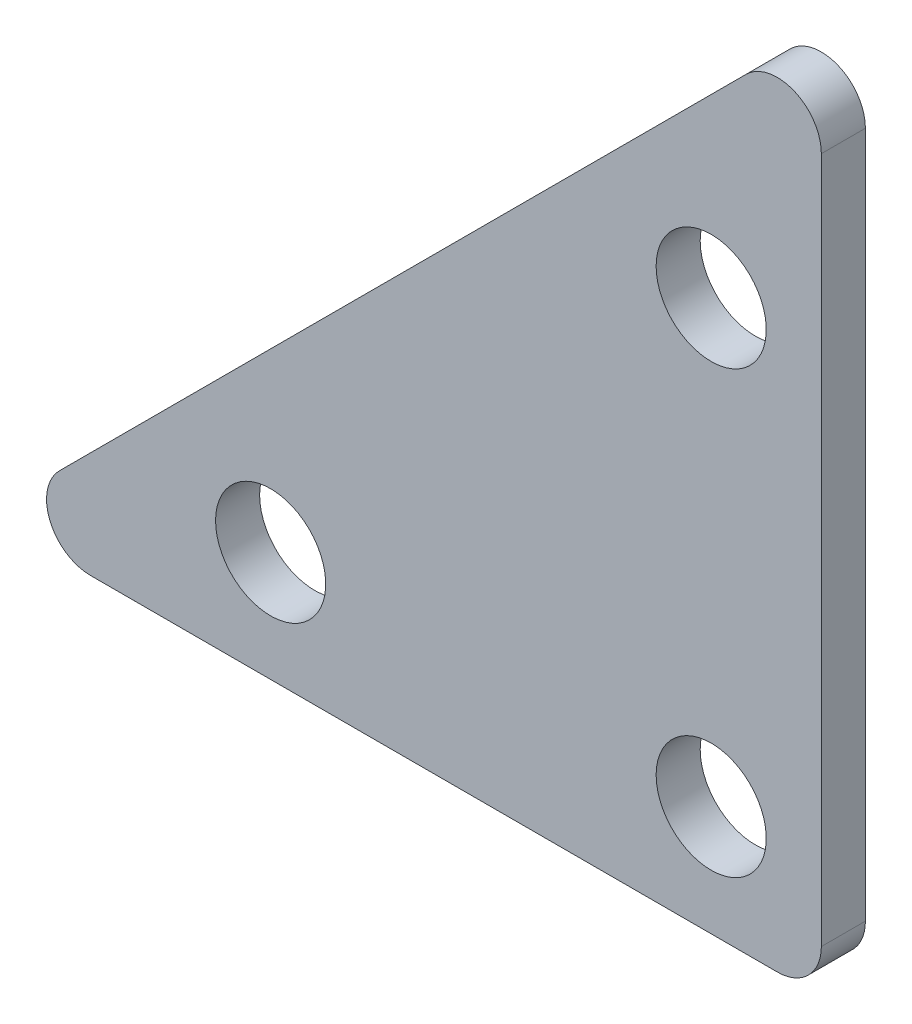
ISO-10303-21;
HEADER;
FILE_DESCRIPTION(('STEP AP214'),'2;1');
FILE_NAME('part.step','',(''),(''),'','','');
FILE_SCHEMA(('AUTOMOTIVE_DESIGN { 1 0 10303 214 1 1 1 1 }'));
ENDSEC;
DATA;
#1=APPLICATION_CONTEXT('core data for automotive mechanical design processes');
#2=APPLICATION_PROTOCOL_DEFINITION('international standard','automotive_design',2000,#1);
#3=PRODUCT_CONTEXT('',#1,'mechanical');
#4=PRODUCT('Part','Part','',(#3));
#5=PRODUCT_RELATED_PRODUCT_CATEGORY('part','',(#4));
#6=PRODUCT_DEFINITION_FORMATION('','',#4);
#7=PRODUCT_DEFINITION_CONTEXT('part definition',#1,'design');
#8=PRODUCT_DEFINITION('design','',#6,#7);
#9=PRODUCT_DEFINITION_SHAPE('','',#8);
#10=(LENGTH_UNIT() NAMED_UNIT(*) SI_UNIT(.MILLI.,.METRE.));
#11=(NAMED_UNIT(*) PLANE_ANGLE_UNIT() SI_UNIT($,.RADIAN.));
#12=(NAMED_UNIT(*) SI_UNIT($,.STERADIAN.) SOLID_ANGLE_UNIT());
#13=UNCERTAINTY_MEASURE_WITH_UNIT(LENGTH_MEASURE(1.E-05),#10,'distance_accuracy_value','');
#14=(GEOMETRIC_REPRESENTATION_CONTEXT(3) GLOBAL_UNCERTAINTY_ASSIGNED_CONTEXT((#13)) GLOBAL_UNIT_ASSIGNED_CONTEXT((#10,
#11,#12)) REPRESENTATION_CONTEXT('',''));
#15=CARTESIAN_POINT('',(0.,0.,0.));
#16=DIRECTION('',(0.,0.,1.));
#17=DIRECTION('',(1.,0.,0.));
#18=AXIS2_PLACEMENT_3D('',#15,#16,#17);
#19=CARTESIAN_POINT('',(-38.,0.,2.));
#20=DIRECTION('',(0.,1.,0.));
#21=DIRECTION('',(0.,0.,1.));
#22=AXIS2_PLACEMENT_3D('',#19,#20,#21);
#23=PLANE('',#22);
#24=DIRECTION('',(1.,0.,0.));
#25=VECTOR('',#24,1.);
#26=CARTESIAN_POINT('',(-38.,0.,0.));
#27=LINE('',#26,#25);
#28=CARTESIAN_POINT('',(-33.1715728752538,0.,0.));
#29=VERTEX_POINT('',#28);
#30=CARTESIAN_POINT('',(-2.,0.,0.));
#31=VERTEX_POINT('',#30);
#32=EDGE_CURVE('E124',#29,#31,#27,.T.);
#33=ORIENTED_EDGE('',*,*,#32,.T.);
#34=DIRECTION('',(0.,0.,-1.));
#35=VECTOR('',#34,1.);
#36=CARTESIAN_POINT('',(-2.,0.,2.));
#37=LINE('',#36,#35);
#38=CARTESIAN_POINT('',(-2.,0.,2.));
#39=VERTEX_POINT('',#38);
#40=EDGE_CURVE('E103',#31,#39,#37,.F.);
#41=ORIENTED_EDGE('',*,*,#40,.T.);
#42=DIRECTION('',(1.,0.,0.));
#43=VECTOR('',#42,1.);
#44=CARTESIAN_POINT('',(-38.,0.,2.));
#45=LINE('',#44,#43);
#46=CARTESIAN_POINT('',(-33.1715728752538,0.,2.));
#47=VERTEX_POINT('',#46);
#48=EDGE_CURVE('E126',#47,#39,#45,.T.);
#49=ORIENTED_EDGE('',*,*,#48,.F.);
#50=DIRECTION('',(0.,0.,-1.));
#51=VECTOR('',#50,1.);
#52=CARTESIAN_POINT('',(-33.1715728752538,0.,2.));
#53=LINE('',#52,#51);
#54=EDGE_CURVE('E108',#47,#29,#53,.T.);
#55=ORIENTED_EDGE('',*,*,#54,.T.);
#56=EDGE_LOOP('',(#33,#41,#49,#55));
#57=FACE_BOUND('',#56,.T.);
#58=ADVANCED_FACE('F44',(#57),#23,.F.);
#59=CARTESIAN_POINT('',(0.,0.,2.));
#60=DIRECTION('',(-1.,0.,0.));
#61=DIRECTION('',(0.,0.,1.));
#62=AXIS2_PLACEMENT_3D('',#59,#60,#61);
#63=PLANE('',#62);
#64=DIRECTION('',(0.,1.,0.));
#65=VECTOR('',#64,1.);
#66=CARTESIAN_POINT('',(0.,0.,2.));
#67=LINE('',#66,#65);
#68=CARTESIAN_POINT('',(0.,2.,2.));
#69=VERTEX_POINT('',#68);
#70=CARTESIAN_POINT('',(0.,33.1715728752538,2.));
#71=VERTEX_POINT('',#70);
#72=EDGE_CURVE('E117',#69,#71,#67,.T.);
#73=ORIENTED_EDGE('',*,*,#72,.F.);
#74=DIRECTION('',(0.,0.,-1.));
#75=VECTOR('',#74,1.);
#76=CARTESIAN_POINT('',(0.,2.,2.));
#77=LINE('',#76,#75);
#78=CARTESIAN_POINT('',(0.,2.,0.));
#79=VERTEX_POINT('',#78);
#80=EDGE_CURVE('E102',#69,#79,#77,.T.);
#81=ORIENTED_EDGE('',*,*,#80,.T.);
#82=DIRECTION('',(0.,1.,0.));
#83=VECTOR('',#82,1.);
#84=CARTESIAN_POINT('',(0.,0.,0.));
#85=LINE('',#84,#83);
#86=CARTESIAN_POINT('',(0.,33.1715728752538,0.));
#87=VERTEX_POINT('',#86);
#88=EDGE_CURVE('E115',#79,#87,#85,.T.);
#89=ORIENTED_EDGE('',*,*,#88,.T.);
#90=DIRECTION('',(0.,0.,-1.));
#91=VECTOR('',#90,1.);
#92=CARTESIAN_POINT('',(0.,33.1715728752538,2.));
#93=LINE('',#92,#91);
#94=EDGE_CURVE('E119',#87,#71,#93,.F.);
#95=ORIENTED_EDGE('',*,*,#94,.T.);
#96=EDGE_LOOP('',(#73,#81,#89,#95));
#97=FACE_BOUND('',#96,.T.);
#98=ADVANCED_FACE('F114',(#97),#63,.F.);
#99=CARTESIAN_POINT('',(0.,38.,2.));
#100=DIRECTION('',(0.707106781186547,-0.707106781186547,0.));
#101=DIRECTION('',(0.707106781186548,0.707106781186548,0.));
#102=AXIS2_PLACEMENT_3D('',#99,#100,#101);
#103=PLANE('',#102);
#104=DIRECTION('',(-0.707106781186548,-0.707106781186548,0.));
#105=VECTOR('',#104,1.);
#106=CARTESIAN_POINT('',(0.,38.,2.));
#107=LINE('',#106,#105);
#108=CARTESIAN_POINT('',(-3.41421356237309,34.5857864376269,2.));
#109=VERTEX_POINT('',#108);
#110=CARTESIAN_POINT('',(-34.5857864376269,3.41421356237309,2.));
#111=VERTEX_POINT('',#110);
#112=EDGE_CURVE('E132',#109,#111,#107,.T.);
#113=ORIENTED_EDGE('',*,*,#112,.F.);
#114=DIRECTION('',(0.,0.,-1.));
#115=VECTOR('',#114,1.);
#116=CARTESIAN_POINT('',(-3.41421356237309,34.5857864376269,2.));
#117=LINE('',#116,#115);
#118=CARTESIAN_POINT('',(-3.41421356237309,34.5857864376269,0.));
#119=VERTEX_POINT('',#118);
#120=EDGE_CURVE('E13',#109,#119,#117,.T.);
#121=ORIENTED_EDGE('',*,*,#120,.T.);
#122=DIRECTION('',(-0.707106781186548,-0.707106781186548,0.));
#123=VECTOR('',#122,1.);
#124=CARTESIAN_POINT('',(0.,38.,0.));
#125=LINE('',#124,#123);
#126=CARTESIAN_POINT('',(-34.5857864376269,3.41421356237309,0.));
#127=VERTEX_POINT('',#126);
#128=EDGE_CURVE('E123',#119,#127,#125,.T.);
#129=ORIENTED_EDGE('',*,*,#128,.T.);
#130=DIRECTION('',(0.,0.,-1.));
#131=VECTOR('',#130,1.);
#132=CARTESIAN_POINT('',(-34.5857864376269,3.4142135623731,2.));
#133=LINE('',#132,#131);
#134=EDGE_CURVE('E52',#127,#111,#133,.F.);
#135=ORIENTED_EDGE('',*,*,#134,.T.);
#136=EDGE_LOOP('',(#113,#121,#129,#135));
#137=FACE_BOUND('',#136,.T.);
#138=ADVANCED_FACE('F155',(#137),#103,.F.);
#139=CARTESIAN_POINT('',(0.,0.,2.));
#140=DIRECTION('',(0.,0.,1.));
#141=DIRECTION('',(1.,0.,0.));
#142=AXIS2_PLACEMENT_3D('',#139,#140,#141);
#143=PLANE('',#142);
#144=CARTESIAN_POINT('',(-5.,25.,2.));
#145=DIRECTION('',(0.,0.,-1.));
#146=DIRECTION('',(-1.,0.,0.));
#147=AXIS2_PLACEMENT_3D('',#144,#145,#146);
#148=CIRCLE('',#147,2.5);
#149=CARTESIAN_POINT('',(-7.5,25.,2.));
#150=VERTEX_POINT('',#149);
#151=EDGE_CURVE('E195',#150,#150,#148,.T.);
#152=ORIENTED_EDGE('',*,*,#151,.T.);
#153=EDGE_LOOP('',(#152));
#154=FACE_BOUND('',#153,.T.);
#155=CARTESIAN_POINT('',(-5.,5.,2.));
#156=DIRECTION('',(0.,0.,-1.));
#157=DIRECTION('',(-1.,0.,0.));
#158=AXIS2_PLACEMENT_3D('',#155,#156,#157);
#159=CIRCLE('',#158,2.5);
#160=CARTESIAN_POINT('',(-7.5,5.,2.));
#161=VERTEX_POINT('',#160);
#162=EDGE_CURVE('E205',#161,#161,#159,.T.);
#163=ORIENTED_EDGE('',*,*,#162,.T.);
#164=EDGE_LOOP('',(#163));
#165=FACE_BOUND('',#164,.T.);
#166=CARTESIAN_POINT('',(-25.,5.,2.));
#167=DIRECTION('',(0.,0.,-1.));
#168=DIRECTION('',(-1.,0.,0.));
#169=AXIS2_PLACEMENT_3D('',#166,#167,#168);
#170=CIRCLE('',#169,2.5);
#171=CARTESIAN_POINT('',(-27.5,5.,2.));
#172=VERTEX_POINT('',#171);
#173=EDGE_CURVE('E128',#172,#172,#170,.T.);
#174=ORIENTED_EDGE('',*,*,#173,.T.);
#175=EDGE_LOOP('',(#174));
#176=FACE_BOUND('',#175,.T.);
#177=ORIENTED_EDGE('',*,*,#48,.T.);
#178=CARTESIAN_POINT('',(-2.,2.,2.));
#179=DIRECTION('',(0.,0.,1.));
#180=DIRECTION('',(1.,0.,0.));
#181=AXIS2_PLACEMENT_3D('',#178,#179,#180);
#182=CIRCLE('',#181,2.);
#183=EDGE_CURVE('E142',#39,#69,#182,.T.);
#184=ORIENTED_EDGE('',*,*,#183,.T.);
#185=ORIENTED_EDGE('',*,*,#72,.T.);
#186=CARTESIAN_POINT('',(-2.,33.1715728752538,2.));
#187=DIRECTION('',(0.,0.,1.));
#188=DIRECTION('',(1.,0.,0.));
#189=AXIS2_PLACEMENT_3D('',#186,#187,#188);
#190=CIRCLE('',#189,2.);
#191=EDGE_CURVE('E65',#71,#109,#190,.T.);
#192=ORIENTED_EDGE('',*,*,#191,.T.);
#193=ORIENTED_EDGE('',*,*,#112,.T.);
#194=CARTESIAN_POINT('',(-33.1715728752538,2.,2.));
#195=DIRECTION('',(0.,0.,1.));
#196=DIRECTION('',(1.,0.,0.));
#197=AXIS2_PLACEMENT_3D('',#194,#195,#196);
#198=CIRCLE('',#197,2.);
#199=EDGE_CURVE('E139',#111,#47,#198,.T.);
#200=ORIENTED_EDGE('',*,*,#199,.T.);
#201=EDGE_LOOP('',(#177,#184,#185,#192,#193,#200));
#202=FACE_BOUND('',#201,.T.);
#203=ADVANCED_FACE('F144',(#154,#165,#176,#202),#143,.T.);
#204=CARTESIAN_POINT('',(0.,0.,0.));
#205=DIRECTION('',(0.,0.,1.));
#206=DIRECTION('',(1.,0.,0.));
#207=AXIS2_PLACEMENT_3D('',#204,#205,#206);
#208=PLANE('',#207);
#209=CARTESIAN_POINT('',(-5.,25.,0.));
#210=DIRECTION('',(0.,0.,-1.));
#211=DIRECTION('',(-1.,0.,0.));
#212=AXIS2_PLACEMENT_3D('',#209,#210,#211);
#213=CIRCLE('',#212,2.49999999999999);
#214=CARTESIAN_POINT('',(-7.49999999999999,25.,0.));
#215=VERTEX_POINT('',#214);
#216=EDGE_CURVE('E198',#215,#215,#213,.T.);
#217=ORIENTED_EDGE('',*,*,#216,.F.);
#218=EDGE_LOOP('',(#217));
#219=FACE_BOUND('',#218,.T.);
#220=CARTESIAN_POINT('',(-5.,5.,0.));
#221=DIRECTION('',(0.,0.,-1.));
#222=DIRECTION('',(-1.,0.,0.));
#223=AXIS2_PLACEMENT_3D('',#220,#221,#222);
#224=CIRCLE('',#223,2.49999999999999);
#225=CARTESIAN_POINT('',(-7.49999999999999,5.,0.));
#226=VERTEX_POINT('',#225);
#227=EDGE_CURVE('E200',#226,#226,#224,.T.);
#228=ORIENTED_EDGE('',*,*,#227,.F.);
#229=EDGE_LOOP('',(#228));
#230=FACE_BOUND('',#229,.T.);
#231=CARTESIAN_POINT('',(-25.,5.,0.));
#232=DIRECTION('',(0.,0.,-1.));
#233=DIRECTION('',(-1.,0.,0.));
#234=AXIS2_PLACEMENT_3D('',#231,#232,#233);
#235=CIRCLE('',#234,2.49999999999999);
#236=CARTESIAN_POINT('',(-27.5,5.,0.));
#237=VERTEX_POINT('',#236);
#238=EDGE_CURVE('E207',#237,#237,#235,.T.);
#239=ORIENTED_EDGE('',*,*,#238,.F.);
#240=EDGE_LOOP('',(#239));
#241=FACE_BOUND('',#240,.T.);
#242=ORIENTED_EDGE('',*,*,#88,.F.);
#243=CARTESIAN_POINT('',(-2.,2.,0.));
#244=DIRECTION('',(0.,0.,1.));
#245=DIRECTION('',(1.,0.,0.));
#246=AXIS2_PLACEMENT_3D('',#243,#244,#245);
#247=CIRCLE('',#246,2.);
#248=EDGE_CURVE('E98',#79,#31,#247,.F.);
#249=ORIENTED_EDGE('',*,*,#248,.T.);
#250=ORIENTED_EDGE('',*,*,#32,.F.);
#251=CARTESIAN_POINT('',(-33.1715728752538,2.,0.));
#252=DIRECTION('',(0.,0.,1.));
#253=DIRECTION('',(1.,0.,0.));
#254=AXIS2_PLACEMENT_3D('',#251,#252,#253);
#255=CIRCLE('',#254,2.);
#256=EDGE_CURVE('E118',#29,#127,#255,.F.);
#257=ORIENTED_EDGE('',*,*,#256,.T.);
#258=ORIENTED_EDGE('',*,*,#128,.F.);
#259=CARTESIAN_POINT('',(-2.,33.1715728752538,0.));
#260=DIRECTION('',(0.,0.,1.));
#261=DIRECTION('',(1.,0.,0.));
#262=AXIS2_PLACEMENT_3D('',#259,#260,#261);
#263=CIRCLE('',#262,2.);
#264=EDGE_CURVE('E109',#119,#87,#263,.F.);
#265=ORIENTED_EDGE('',*,*,#264,.T.);
#266=EDGE_LOOP('',(#242,#249,#250,#257,#258,#265));
#267=FACE_BOUND('',#266,.T.);
#268=ADVANCED_FACE('F121',(#219,#230,#241,#267),#208,.F.);
#269=CARTESIAN_POINT('',(-25.,5.,0.));
#270=DIRECTION('',(0.,0.,-1.));
#271=DIRECTION('',(-1.,0.,0.));
#272=AXIS2_PLACEMENT_3D('',#269,#270,#271);
#273=CYLINDRICAL_SURFACE('',#272,2.49999999999999);
#274=ORIENTED_EDGE('',*,*,#173,.F.);
#275=EDGE_LOOP('',(#274));
#276=FACE_BOUND('',#275,.T.);
#277=ORIENTED_EDGE('',*,*,#238,.T.);
#278=EDGE_LOOP('',(#277));
#279=FACE_BOUND('',#278,.T.);
#280=ADVANCED_FACE('F176',(#276,#279),#273,.F.);
#281=CARTESIAN_POINT('',(-5.,5.,0.));
#282=DIRECTION('',(0.,0.,-1.));
#283=DIRECTION('',(-1.,0.,0.));
#284=AXIS2_PLACEMENT_3D('',#281,#282,#283);
#285=CYLINDRICAL_SURFACE('',#284,2.49999999999999);
#286=ORIENTED_EDGE('',*,*,#162,.F.);
#287=EDGE_LOOP('',(#286));
#288=FACE_BOUND('',#287,.T.);
#289=ORIENTED_EDGE('',*,*,#227,.T.);
#290=EDGE_LOOP('',(#289));
#291=FACE_BOUND('',#290,.T.);
#292=ADVANCED_FACE('F183',(#288,#291),#285,.F.);
#293=CARTESIAN_POINT('',(-5.,25.,0.));
#294=DIRECTION('',(0.,0.,-1.));
#295=DIRECTION('',(-1.,0.,0.));
#296=AXIS2_PLACEMENT_3D('',#293,#294,#295);
#297=CYLINDRICAL_SURFACE('',#296,2.49999999999999);
#298=ORIENTED_EDGE('',*,*,#151,.F.);
#299=EDGE_LOOP('',(#298));
#300=FACE_BOUND('',#299,.T.);
#301=ORIENTED_EDGE('',*,*,#216,.T.);
#302=EDGE_LOOP('',(#301));
#303=FACE_BOUND('',#302,.T.);
#304=ADVANCED_FACE('F163',(#300,#303),#297,.F.);
#305=CARTESIAN_POINT('',(-2.,2.,2.));
#306=DIRECTION('',(0.,0.,-1.));
#307=DIRECTION('',(-1.,0.,0.));
#308=AXIS2_PLACEMENT_3D('',#305,#306,#307);
#309=CYLINDRICAL_SURFACE('',#308,2.);
#310=ORIENTED_EDGE('',*,*,#183,.F.);
#311=ORIENTED_EDGE('',*,*,#40,.F.);
#312=ORIENTED_EDGE('',*,*,#248,.F.);
#313=ORIENTED_EDGE('',*,*,#80,.F.);
#314=EDGE_LOOP('',(#310,#311,#312,#313));
#315=FACE_BOUND('',#314,.T.);
#316=ADVANCED_FACE('F101',(#315),#309,.T.);
#317=CARTESIAN_POINT('',(-2.,33.1715728752538,2.));
#318=DIRECTION('',(0.,0.,-1.));
#319=DIRECTION('',(-1.,0.,0.));
#320=AXIS2_PLACEMENT_3D('',#317,#318,#319);
#321=CYLINDRICAL_SURFACE('',#320,2.);
#322=ORIENTED_EDGE('',*,*,#191,.F.);
#323=ORIENTED_EDGE('',*,*,#94,.F.);
#324=ORIENTED_EDGE('',*,*,#264,.F.);
#325=ORIENTED_EDGE('',*,*,#120,.F.);
#326=EDGE_LOOP('',(#322,#323,#324,#325));
#327=FACE_BOUND('',#326,.T.);
#328=ADVANCED_FACE('F157',(#327),#321,.T.);
#329=CARTESIAN_POINT('',(-33.1715728752538,2.,2.));
#330=DIRECTION('',(0.,0.,-1.));
#331=DIRECTION('',(-1.,0.,0.));
#332=AXIS2_PLACEMENT_3D('',#329,#330,#331);
#333=CYLINDRICAL_SURFACE('',#332,2.);
#334=ORIENTED_EDGE('',*,*,#199,.F.);
#335=ORIENTED_EDGE('',*,*,#134,.F.);
#336=ORIENTED_EDGE('',*,*,#256,.F.);
#337=ORIENTED_EDGE('',*,*,#54,.F.);
#338=EDGE_LOOP('',(#334,#335,#336,#337));
#339=FACE_BOUND('',#338,.T.);
#340=ADVANCED_FACE('F46',(#339),#333,.T.);
#341=CLOSED_SHELL('',(#58,#98,#138,#203,#268,#280,#292,#304,#316,#328,#340));
#342=MANIFOLD_SOLID_BREP('B2',#341);
#343=ADVANCED_BREP_SHAPE_REPRESENTATION('',(#18,#342),#14);
#344=SHAPE_DEFINITION_REPRESENTATION(#9,#343);
ENDSEC;
END-ISO-10303-21;
